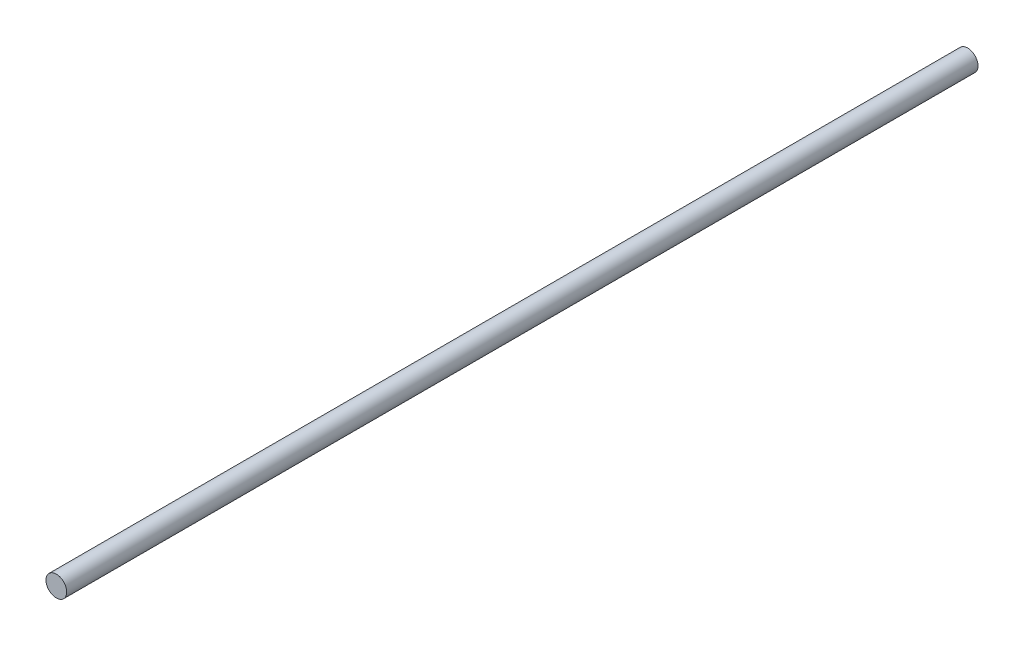
ISO-10303-21;
HEADER;
FILE_DESCRIPTION(('STEP AP214'),'2;1');
FILE_NAME('part.step','',(''),(''),'','','');
FILE_SCHEMA(('AUTOMOTIVE_DESIGN { 1 0 10303 214 1 1 1 1 }'));
ENDSEC;
DATA;
#1=APPLICATION_CONTEXT('core data for automotive mechanical design processes');
#2=APPLICATION_PROTOCOL_DEFINITION('international standard','automotive_design',2000,#1);
#3=PRODUCT_CONTEXT('',#1,'mechanical');
#4=PRODUCT('Part','Part','',(#3));
#5=PRODUCT_RELATED_PRODUCT_CATEGORY('part','',(#4));
#6=PRODUCT_DEFINITION_FORMATION('','',#4);
#7=PRODUCT_DEFINITION_CONTEXT('part definition',#1,'design');
#8=PRODUCT_DEFINITION('design','',#6,#7);
#9=PRODUCT_DEFINITION_SHAPE('','',#8);
#10=(LENGTH_UNIT() NAMED_UNIT(*) SI_UNIT(.MILLI.,.METRE.));
#11=(NAMED_UNIT(*) PLANE_ANGLE_UNIT() SI_UNIT($,.RADIAN.));
#12=(NAMED_UNIT(*) SI_UNIT($,.STERADIAN.) SOLID_ANGLE_UNIT());
#13=UNCERTAINTY_MEASURE_WITH_UNIT(LENGTH_MEASURE(1.E-05),#10,'distance_accuracy_value','');
#14=(GEOMETRIC_REPRESENTATION_CONTEXT(3) GLOBAL_UNCERTAINTY_ASSIGNED_CONTEXT((#13)) GLOBAL_UNIT_ASSIGNED_CONTEXT((#10,
#11,#12)) REPRESENTATION_CONTEXT('',''));
#15=CARTESIAN_POINT('',(0.,0.,0.));
#16=DIRECTION('',(0.,0.,1.));
#17=DIRECTION('',(1.,0.,0.));
#18=AXIS2_PLACEMENT_3D('',#15,#16,#17);
#19=CARTESIAN_POINT('',(0.,0.,279.4));
#20=DIRECTION('',(0.,0.,-1.));
#21=DIRECTION('',(-1.,0.,0.));
#22=AXIS2_PLACEMENT_3D('',#19,#20,#21);
#23=CYLINDRICAL_SURFACE('',#22,3.175);
#24=CARTESIAN_POINT('',(0.,0.,279.4));
#25=DIRECTION('',(0.,0.,1.));
#26=DIRECTION('',(1.,0.,0.));
#27=AXIS2_PLACEMENT_3D('',#24,#25,#26);
#28=CIRCLE('',#27,3.175);
#29=CARTESIAN_POINT('',(3.175,0.,279.4));
#30=VERTEX_POINT('',#29);
#31=EDGE_CURVE('E10',#30,#30,#28,.T.);
#32=ORIENTED_EDGE('',*,*,#31,.F.);
#33=EDGE_LOOP('',(#32));
#34=FACE_BOUND('',#33,.T.);
#35=CARTESIAN_POINT('',(0.,0.,0.));
#36=DIRECTION('',(0.,0.,1.));
#37=DIRECTION('',(1.,0.,0.));
#38=AXIS2_PLACEMENT_3D('',#35,#36,#37);
#39=CIRCLE('',#38,3.175);
#40=CARTESIAN_POINT('',(3.175,0.,0.));
#41=VERTEX_POINT('',#40);
#42=EDGE_CURVE('E36',#41,#41,#39,.T.);
#43=ORIENTED_EDGE('',*,*,#42,.T.);
#44=EDGE_LOOP('',(#43));
#45=FACE_BOUND('',#44,.T.);
#46=ADVANCED_FACE('F33',(#34,#45),#23,.T.);
#47=CARTESIAN_POINT('',(0.,0.,279.4));
#48=DIRECTION('',(0.,0.,1.));
#49=DIRECTION('',(1.,0.,0.));
#50=AXIS2_PLACEMENT_3D('',#47,#48,#49);
#51=PLANE('',#50);
#52=ORIENTED_EDGE('',*,*,#31,.T.);
#53=EDGE_LOOP('',(#52));
#54=FACE_BOUND('',#53,.T.);
#55=ADVANCED_FACE('F48',(#54),#51,.T.);
#56=CARTESIAN_POINT('',(0.,0.,0.));
#57=DIRECTION('',(0.,0.,1.));
#58=DIRECTION('',(1.,0.,0.));
#59=AXIS2_PLACEMENT_3D('',#56,#57,#58);
#60=PLANE('',#59);
#61=ORIENTED_EDGE('',*,*,#42,.F.);
#62=EDGE_LOOP('',(#61));
#63=FACE_BOUND('',#62,.T.);
#64=ADVANCED_FACE('F46',(#63),#60,.F.);
#65=CLOSED_SHELL('',(#46,#55,#64));
#66=MANIFOLD_SOLID_BREP('B2',#65);
#67=ADVANCED_BREP_SHAPE_REPRESENTATION('',(#18,#66),#14);
#68=SHAPE_DEFINITION_REPRESENTATION(#9,#67);
ENDSEC;
END-ISO-10303-21;
